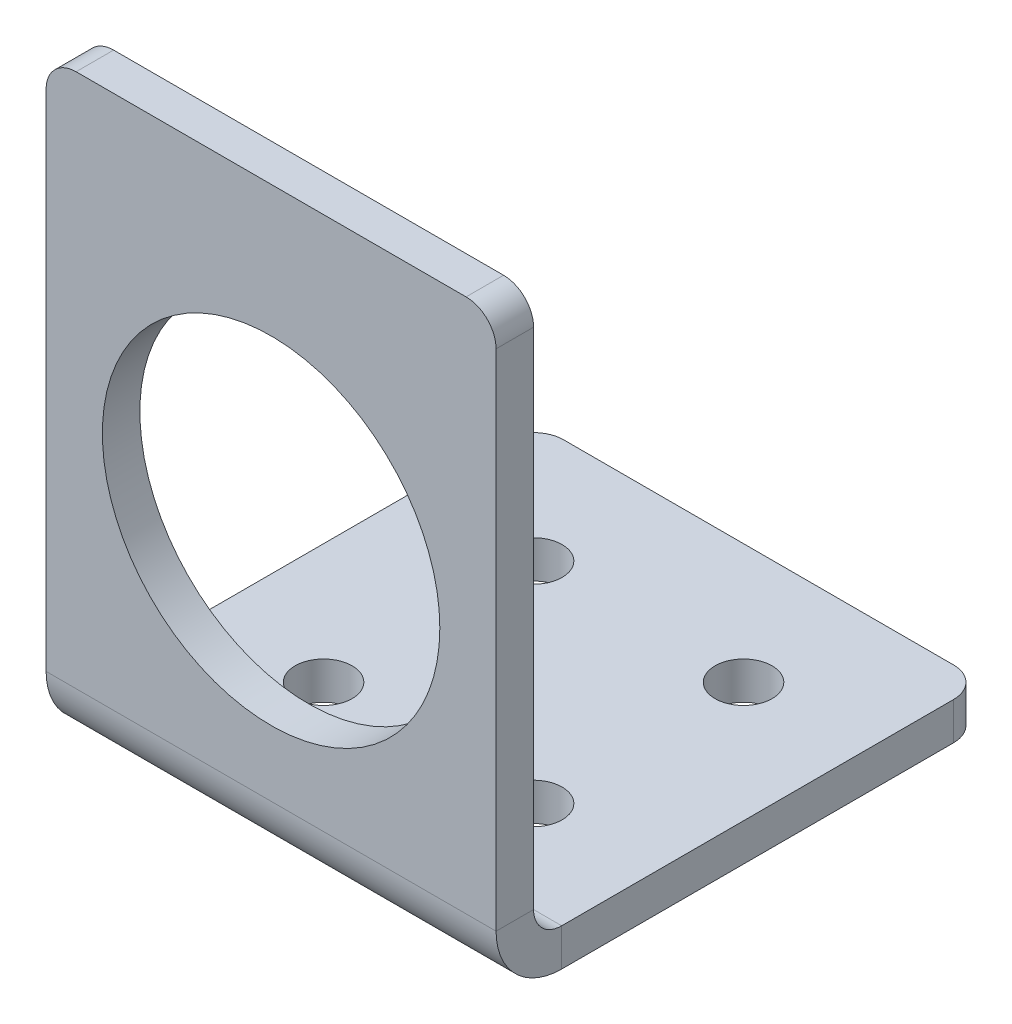
ISO-10303-21;
HEADER;
FILE_DESCRIPTION(('STEP AP214'),'2;1');
FILE_NAME('part.step','',(''),(''),'','','');
FILE_SCHEMA(('AUTOMOTIVE_DESIGN { 1 0 10303 214 1 1 1 1 }'));
ENDSEC;
DATA;
#1=APPLICATION_CONTEXT('core data for automotive mechanical design processes');
#2=APPLICATION_PROTOCOL_DEFINITION('international standard','automotive_design',2000,#1);
#3=PRODUCT_CONTEXT('',#1,'mechanical');
#4=PRODUCT('Part','Part','',(#3));
#5=PRODUCT_RELATED_PRODUCT_CATEGORY('part','',(#4));
#6=PRODUCT_DEFINITION_FORMATION('','',#4);
#7=PRODUCT_DEFINITION_CONTEXT('part definition',#1,'design');
#8=PRODUCT_DEFINITION('design','',#6,#7);
#9=PRODUCT_DEFINITION_SHAPE('','',#8);
#10=(LENGTH_UNIT() NAMED_UNIT(*) SI_UNIT(.MILLI.,.METRE.));
#11=(NAMED_UNIT(*) PLANE_ANGLE_UNIT() SI_UNIT($,.RADIAN.));
#12=(NAMED_UNIT(*) SI_UNIT($,.STERADIAN.) SOLID_ANGLE_UNIT());
#13=UNCERTAINTY_MEASURE_WITH_UNIT(LENGTH_MEASURE(1.E-05),#10,'distance_accuracy_value','');
#14=(GEOMETRIC_REPRESENTATION_CONTEXT(3) GLOBAL_UNCERTAINTY_ASSIGNED_CONTEXT((#13)) GLOBAL_UNIT_ASSIGNED_CONTEXT((#10,
#11,#12)) REPRESENTATION_CONTEXT('',''));
#15=CARTESIAN_POINT('',(0.,0.,0.));
#16=DIRECTION('',(0.,0.,1.));
#17=DIRECTION('',(1.,0.,0.));
#18=AXIS2_PLACEMENT_3D('',#15,#16,#17);
#19=CARTESIAN_POINT('',(19.05,-22.225,-38.1));
#20=DIRECTION('',(1.,0.,0.));
#21=DIRECTION('',(0.,0.,1.));
#22=AXIS2_PLACEMENT_3D('',#19,#20,#21);
#23=PLANE('',#22);
#24=DIRECTION('',(0.,0.,1.));
#25=VECTOR('',#24,1.);
#26=CARTESIAN_POINT('',(19.05,-25.4,-38.1));
#27=LINE('',#26,#25);
#28=CARTESIAN_POINT('',(19.05,-25.4,-35.56));
#29=VERTEX_POINT('',#28);
#30=CARTESIAN_POINT('',(19.05,-25.4,-2.38000006600003));
#31=VERTEX_POINT('',#30);
#32=EDGE_CURVE('E197',#29,#31,#27,.T.);
#33=ORIENTED_EDGE('',*,*,#32,.F.);
#34=DIRECTION('',(0.,1.,0.));
#35=VECTOR('',#34,1.);
#36=CARTESIAN_POINT('',(19.05,-22.225,-35.56));
#37=LINE('',#36,#35);
#38=CARTESIAN_POINT('',(19.05,-22.225,-35.56));
#39=VERTEX_POINT('',#38);
#40=EDGE_CURVE('E133',#29,#39,#37,.T.);
#41=ORIENTED_EDGE('',*,*,#40,.T.);
#42=DIRECTION('',(0.,0.,1.));
#43=VECTOR('',#42,1.);
#44=CARTESIAN_POINT('',(19.05,-22.225,-38.1));
#45=LINE('',#44,#43);
#46=CARTESIAN_POINT('',(19.05,-22.225,-2.38000006600001));
#47=VERTEX_POINT('',#46);
#48=EDGE_CURVE('E127',#39,#47,#45,.T.);
#49=ORIENTED_EDGE('',*,*,#48,.T.);
#50=DIRECTION('',(0.,1.,0.));
#51=VECTOR('',#50,1.);
#52=CARTESIAN_POINT('',(19.05,-22.225,-2.38000006600001));
#53=LINE('',#52,#51);
#54=EDGE_CURVE('E130',#31,#47,#53,.T.);
#55=ORIENTED_EDGE('',*,*,#54,.F.);
#56=EDGE_LOOP('',(#33,#41,#49,#55));
#57=FACE_BOUND('',#56,.T.);
#58=ADVANCED_FACE('F36',(#57),#23,.T.);
#59=CARTESIAN_POINT('',(19.05,-22.225,-38.1));
#60=DIRECTION('',(0.,0.,-1.));
#61=DIRECTION('',(1.,0.,0.));
#62=AXIS2_PLACEMENT_3D('',#59,#60,#61);
#63=PLANE('',#62);
#64=DIRECTION('',(1.,0.,0.));
#65=VECTOR('',#64,1.);
#66=CARTESIAN_POINT('',(19.05,-22.225,-38.1));
#67=LINE('',#66,#65);
#68=CARTESIAN_POINT('',(-16.51,-22.225,-38.1));
#69=VERTEX_POINT('',#68);
#70=CARTESIAN_POINT('',(16.51,-22.225,-38.1));
#71=VERTEX_POINT('',#70);
#72=EDGE_CURVE('E136',#69,#71,#67,.T.);
#73=ORIENTED_EDGE('',*,*,#72,.T.);
#74=DIRECTION('',(0.,1.,0.));
#75=VECTOR('',#74,1.);
#76=CARTESIAN_POINT('',(16.51,-22.225,-38.1));
#77=LINE('',#76,#75);
#78=CARTESIAN_POINT('',(16.51,-25.4,-38.1));
#79=VERTEX_POINT('',#78);
#80=EDGE_CURVE('E57',#71,#79,#77,.F.);
#81=ORIENTED_EDGE('',*,*,#80,.T.);
#82=DIRECTION('',(1.,0.,0.));
#83=VECTOR('',#82,1.);
#84=CARTESIAN_POINT('',(19.05,-25.4,-38.1));
#85=LINE('',#84,#83);
#86=CARTESIAN_POINT('',(-16.51,-25.4,-38.1));
#87=VERTEX_POINT('',#86);
#88=EDGE_CURVE('E195',#87,#79,#85,.T.);
#89=ORIENTED_EDGE('',*,*,#88,.F.);
#90=DIRECTION('',(0.,-1.,0.));
#91=VECTOR('',#90,1.);
#92=CARTESIAN_POINT('',(-16.51,-22.225,-38.1));
#93=LINE('',#92,#91);
#94=EDGE_CURVE('E240',#87,#69,#93,.F.);
#95=ORIENTED_EDGE('',*,*,#94,.T.);
#96=EDGE_LOOP('',(#73,#81,#89,#95));
#97=FACE_BOUND('',#96,.T.);
#98=ADVANCED_FACE('F252',(#97),#63,.T.);
#99=CARTESIAN_POINT('',(-19.05,-22.225,-38.1));
#100=DIRECTION('',(1.,0.,0.));
#101=DIRECTION('',(0.,0.,1.));
#102=AXIS2_PLACEMENT_3D('',#99,#100,#101);
#103=PLANE('',#102);
#104=DIRECTION('',(0.,0.,1.));
#105=VECTOR('',#104,1.);
#106=CARTESIAN_POINT('',(-19.05,-22.225,-38.1));
#107=LINE('',#106,#105);
#108=CARTESIAN_POINT('',(-19.05,-22.225,-35.56));
#109=VERTEX_POINT('',#108);
#110=CARTESIAN_POINT('',(-19.05,-22.225,-2.38000006600001));
#111=VERTEX_POINT('',#110);
#112=EDGE_CURVE('E163',#109,#111,#107,.T.);
#113=ORIENTED_EDGE('',*,*,#112,.F.);
#114=DIRECTION('',(0.,1.,0.));
#115=VECTOR('',#114,1.);
#116=CARTESIAN_POINT('',(-19.05,-22.225,-35.56));
#117=LINE('',#116,#115);
#118=CARTESIAN_POINT('',(-19.05,-25.4,-35.56));
#119=VERTEX_POINT('',#118);
#120=EDGE_CURVE('E11',#109,#119,#117,.F.);
#121=ORIENTED_EDGE('',*,*,#120,.T.);
#122=DIRECTION('',(0.,0.,1.));
#123=VECTOR('',#122,1.);
#124=CARTESIAN_POINT('',(-19.05,-25.4,-38.1));
#125=LINE('',#124,#123);
#126=CARTESIAN_POINT('',(-19.05,-25.4,-2.38000006600001));
#127=VERTEX_POINT('',#126);
#128=EDGE_CURVE('E189',#119,#127,#125,.T.);
#129=ORIENTED_EDGE('',*,*,#128,.T.);
#130=DIRECTION('',(0.,1.,0.));
#131=VECTOR('',#130,1.);
#132=CARTESIAN_POINT('',(-19.05,-22.225,-2.38000006600001));
#133=LINE('',#132,#131);
#134=EDGE_CURVE('E149',#127,#111,#133,.T.);
#135=ORIENTED_EDGE('',*,*,#134,.T.);
#136=EDGE_LOOP('',(#113,#121,#129,#135));
#137=FACE_BOUND('',#136,.T.);
#138=ADVANCED_FACE('F299',(#137),#103,.F.);
#139=CARTESIAN_POINT('',(-19.05,-19.844999934,-2.380000066));
#140=DIRECTION('',(1.,0.,0.));
#141=DIRECTION('',(0.,0.,-1.));
#142=AXIS2_PLACEMENT_3D('',#139,#140,#141);
#143=PLANE('',#142);
#144=ORIENTED_EDGE('',*,*,#134,.F.);
#145=CARTESIAN_POINT('',(-19.05,-19.844999934,-2.380000066));
#146=DIRECTION('',(1.,0.,0.));
#147=DIRECTION('',(0.,1.,0.));
#148=AXIS2_PLACEMENT_3D('',#145,#146,#147);
#149=CIRCLE('',#148,5.555000066);
#150=CARTESIAN_POINT('',(-19.05,-19.844999934,3.175));
#151=VERTEX_POINT('',#150);
#152=EDGE_CURVE('E190',#127,#151,#149,.F.);
#153=ORIENTED_EDGE('',*,*,#152,.T.);
#154=DIRECTION('',(0.,0.,-1.));
#155=VECTOR('',#154,1.);
#156=CARTESIAN_POINT('',(-19.05,-19.844999934,0.));
#157=LINE('',#156,#155);
#158=CARTESIAN_POINT('',(-19.05,-19.844999934,0.));
#159=VERTEX_POINT('',#158);
#160=EDGE_CURVE('E213',#151,#159,#157,.T.);
#161=ORIENTED_EDGE('',*,*,#160,.T.);
#162=CARTESIAN_POINT('',(-19.05,-19.844999934,-2.380000066));
#163=DIRECTION('',(-1.,0.,0.));
#164=DIRECTION('',(0.,0.,1.));
#165=AXIS2_PLACEMENT_3D('',#162,#163,#164);
#166=CIRCLE('',#165,2.380000066);
#167=EDGE_CURVE('E159',#111,#159,#166,.T.);
#168=ORIENTED_EDGE('',*,*,#167,.F.);
#169=EDGE_LOOP('',(#144,#153,#161,#168));
#170=FACE_BOUND('',#169,.T.);
#171=ADVANCED_FACE('F296',(#170),#143,.F.);
#172=CARTESIAN_POINT('',(-19.05,-25.4,0.));
#173=DIRECTION('',(1.,0.,0.));
#174=DIRECTION('',(0.,-1.,0.));
#175=AXIS2_PLACEMENT_3D('',#172,#173,#174);
#176=PLANE('',#175);
#177=DIRECTION('',(0.,1.,0.));
#178=VECTOR('',#177,1.);
#179=CARTESIAN_POINT('',(-19.05,0.,3.175));
#180=LINE('',#179,#178);
#181=CARTESIAN_POINT('',(-19.05,22.86,3.175));
#182=VERTEX_POINT('',#181);
#183=EDGE_CURVE('E187',#182,#151,#180,.F.);
#184=ORIENTED_EDGE('',*,*,#183,.F.);
#185=DIRECTION('',(0.,0.,1.));
#186=VECTOR('',#185,1.);
#187=CARTESIAN_POINT('',(-19.05,22.86,0.));
#188=LINE('',#187,#186);
#189=CARTESIAN_POINT('',(-19.05,22.86,0.));
#190=VERTEX_POINT('',#189);
#191=EDGE_CURVE('E148',#182,#190,#188,.F.);
#192=ORIENTED_EDGE('',*,*,#191,.T.);
#193=DIRECTION('',(0.,-1.,0.));
#194=VECTOR('',#193,1.);
#195=CARTESIAN_POINT('',(-19.05,-25.4,0.));
#196=LINE('',#195,#194);
#197=EDGE_CURVE('E255',#190,#159,#196,.T.);
#198=ORIENTED_EDGE('',*,*,#197,.T.);
#199=ORIENTED_EDGE('',*,*,#160,.F.);
#200=EDGE_LOOP('',(#184,#192,#198,#199));
#201=FACE_BOUND('',#200,.T.);
#202=ADVANCED_FACE('F288',(#201),#176,.F.);
#203=CARTESIAN_POINT('',(-19.05,25.4,0.));
#204=DIRECTION('',(0.,-1.,0.));
#205=DIRECTION('',(-1.,0.,0.));
#206=AXIS2_PLACEMENT_3D('',#203,#204,#205);
#207=PLANE('',#206);
#208=DIRECTION('',(-1.,0.,0.));
#209=VECTOR('',#208,1.);
#210=CARTESIAN_POINT('',(-19.05,25.4,0.));
#211=LINE('',#210,#209);
#212=CARTESIAN_POINT('',(16.51,25.4,0.));
#213=VERTEX_POINT('',#212);
#214=CARTESIAN_POINT('',(-16.51,25.4,0.));
#215=VERTEX_POINT('',#214);
#216=EDGE_CURVE('E260',#213,#215,#211,.T.);
#217=ORIENTED_EDGE('',*,*,#216,.T.);
#218=DIRECTION('',(0.,0.,1.));
#219=VECTOR('',#218,1.);
#220=CARTESIAN_POINT('',(-16.51,25.4,0.));
#221=LINE('',#220,#219);
#222=CARTESIAN_POINT('',(-16.51,25.4,3.175));
#223=VERTEX_POINT('',#222);
#224=EDGE_CURVE('E227',#215,#223,#221,.T.);
#225=ORIENTED_EDGE('',*,*,#224,.T.);
#226=DIRECTION('',(-1.,0.,0.));
#227=VECTOR('',#226,1.);
#228=CARTESIAN_POINT('',(0.,25.4,3.175));
#229=LINE('',#228,#227);
#230=CARTESIAN_POINT('',(16.51,25.4,3.175));
#231=VERTEX_POINT('',#230);
#232=EDGE_CURVE('E184',#231,#223,#229,.T.);
#233=ORIENTED_EDGE('',*,*,#232,.F.);
#234=DIRECTION('',(0.,0.,1.));
#235=VECTOR('',#234,1.);
#236=CARTESIAN_POINT('',(16.51,25.4,0.));
#237=LINE('',#236,#235);
#238=EDGE_CURVE('E224',#231,#213,#237,.F.);
#239=ORIENTED_EDGE('',*,*,#238,.T.);
#240=EDGE_LOOP('',(#217,#225,#233,#239));
#241=FACE_BOUND('',#240,.T.);
#242=ADVANCED_FACE('F279',(#241),#207,.F.);
#243=CARTESIAN_POINT('',(19.05,-25.4,0.));
#244=DIRECTION('',(-1.,0.,0.));
#245=DIRECTION('',(0.,1.,0.));
#246=AXIS2_PLACEMENT_3D('',#243,#244,#245);
#247=PLANE('',#246);
#248=DIRECTION('',(0.,1.,0.));
#249=VECTOR('',#248,1.);
#250=CARTESIAN_POINT('',(19.05,-25.4,0.));
#251=LINE('',#250,#249);
#252=CARTESIAN_POINT('',(19.05,-19.844999934,0.));
#253=VERTEX_POINT('',#252);
#254=CARTESIAN_POINT('',(19.05,22.86,0.));
#255=VERTEX_POINT('',#254);
#256=EDGE_CURVE('E170',#253,#255,#251,.T.);
#257=ORIENTED_EDGE('',*,*,#256,.T.);
#258=DIRECTION('',(0.,0.,1.));
#259=VECTOR('',#258,1.);
#260=CARTESIAN_POINT('',(19.05,22.86,0.));
#261=LINE('',#260,#259);
#262=CARTESIAN_POINT('',(19.05,22.86,3.175));
#263=VERTEX_POINT('',#262);
#264=EDGE_CURVE('E233',#255,#263,#261,.T.);
#265=ORIENTED_EDGE('',*,*,#264,.T.);
#266=DIRECTION('',(0.,1.,0.));
#267=VECTOR('',#266,1.);
#268=CARTESIAN_POINT('',(19.05,0.,3.175));
#269=LINE('',#268,#267);
#270=CARTESIAN_POINT('',(19.05,-19.844999934,3.175));
#271=VERTEX_POINT('',#270);
#272=EDGE_CURVE('E181',#271,#263,#269,.T.);
#273=ORIENTED_EDGE('',*,*,#272,.F.);
#274=DIRECTION('',(0.,0.,-1.));
#275=VECTOR('',#274,1.);
#276=CARTESIAN_POINT('',(19.05,-19.844999934,0.));
#277=LINE('',#276,#275);
#278=EDGE_CURVE('E167',#271,#253,#277,.T.);
#279=ORIENTED_EDGE('',*,*,#278,.T.);
#280=EDGE_LOOP('',(#257,#265,#273,#279));
#281=FACE_BOUND('',#280,.T.);
#282=ADVANCED_FACE('F265',(#281),#247,.F.);
#283=CARTESIAN_POINT('',(8.89,-22.225,-27.94));
#284=DIRECTION('',(0.,-1.,0.));
#285=DIRECTION('',(1.,0.,0.));
#286=AXIS2_PLACEMENT_3D('',#283,#284,#285);
#287=CYLINDRICAL_SURFACE('',#286,2.413);
#288=CARTESIAN_POINT('',(8.89,-22.225,-27.94));
#289=DIRECTION('',(0.,1.,0.));
#290=DIRECTION('',(-1.,0.,0.));
#291=AXIS2_PLACEMENT_3D('',#288,#289,#290);
#292=CIRCLE('',#291,2.413);
#293=CARTESIAN_POINT('',(6.47699999999999,-22.225,-27.94));
#294=VERTEX_POINT('',#293);
#295=EDGE_CURVE('E175',#294,#294,#292,.T.);
#296=ORIENTED_EDGE('',*,*,#295,.T.);
#297=EDGE_LOOP('',(#296));
#298=FACE_BOUND('',#297,.T.);
#299=CARTESIAN_POINT('',(8.89,-25.4,-27.94));
#300=DIRECTION('',(0.,1.,0.));
#301=DIRECTION('',(-1.,0.,0.));
#302=AXIS2_PLACEMENT_3D('',#299,#300,#301);
#303=CIRCLE('',#302,2.413);
#304=CARTESIAN_POINT('',(6.47699999999999,-25.4,-27.94));
#305=VERTEX_POINT('',#304);
#306=EDGE_CURVE('E193',#305,#305,#303,.T.);
#307=ORIENTED_EDGE('',*,*,#306,.F.);
#308=EDGE_LOOP('',(#307));
#309=FACE_BOUND('',#308,.T.);
#310=ADVANCED_FACE('F321',(#298,#309),#287,.F.);
#311=CARTESIAN_POINT('',(-8.89000000000001,-22.225,-10.16));
#312=DIRECTION('',(0.,-1.,0.));
#313=DIRECTION('',(1.,0.,0.));
#314=AXIS2_PLACEMENT_3D('',#311,#312,#313);
#315=CYLINDRICAL_SURFACE('',#314,2.413);
#316=CARTESIAN_POINT('',(-8.89000000000001,-22.225,-10.16));
#317=DIRECTION('',(0.,1.,0.));
#318=DIRECTION('',(-1.,0.,0.));
#319=AXIS2_PLACEMENT_3D('',#316,#317,#318);
#320=CIRCLE('',#319,2.413);
#321=CARTESIAN_POINT('',(-11.303,-22.225,-10.16));
#322=VERTEX_POINT('',#321);
#323=EDGE_CURVE('E576',#322,#322,#320,.T.);
#324=ORIENTED_EDGE('',*,*,#323,.T.);
#325=EDGE_LOOP('',(#324));
#326=FACE_BOUND('',#325,.T.);
#327=CARTESIAN_POINT('',(-8.89000000000001,-25.4,-10.16));
#328=DIRECTION('',(0.,1.,0.));
#329=DIRECTION('',(-1.,0.,0.));
#330=AXIS2_PLACEMENT_3D('',#327,#328,#329);
#331=CIRCLE('',#330,2.413);
#332=CARTESIAN_POINT('',(-11.303,-25.4,-10.16));
#333=VERTEX_POINT('',#332);
#334=EDGE_CURVE('E205',#333,#333,#331,.T.);
#335=ORIENTED_EDGE('',*,*,#334,.F.);
#336=EDGE_LOOP('',(#335));
#337=FACE_BOUND('',#336,.T.);
#338=ADVANCED_FACE('F324',(#326,#337),#315,.F.);
#339=CARTESIAN_POINT('',(8.88999999999999,-22.225,-10.16));
#340=DIRECTION('',(0.,-1.,0.));
#341=DIRECTION('',(1.,0.,0.));
#342=AXIS2_PLACEMENT_3D('',#339,#340,#341);
#343=CYLINDRICAL_SURFACE('',#342,2.413);
#344=CARTESIAN_POINT('',(8.88999999999999,-22.225,-10.16));
#345=DIRECTION('',(0.,1.,0.));
#346=DIRECTION('',(-1.,0.,0.));
#347=AXIS2_PLACEMENT_3D('',#344,#345,#346);
#348=CIRCLE('',#347,2.413);
#349=CARTESIAN_POINT('',(6.47699999999999,-22.225,-10.16));
#350=VERTEX_POINT('',#349);
#351=EDGE_CURVE('E580',#350,#350,#348,.T.);
#352=ORIENTED_EDGE('',*,*,#351,.T.);
#353=EDGE_LOOP('',(#352));
#354=FACE_BOUND('',#353,.T.);
#355=CARTESIAN_POINT('',(8.88999999999999,-25.4,-10.16));
#356=DIRECTION('',(0.,1.,0.));
#357=DIRECTION('',(-1.,0.,0.));
#358=AXIS2_PLACEMENT_3D('',#355,#356,#357);
#359=CIRCLE('',#358,2.413);
#360=CARTESIAN_POINT('',(6.47699999999999,-25.4,-10.16));
#361=VERTEX_POINT('',#360);
#362=EDGE_CURVE('E208',#361,#361,#359,.T.);
#363=ORIENTED_EDGE('',*,*,#362,.F.);
#364=EDGE_LOOP('',(#363));
#365=FACE_BOUND('',#364,.T.);
#366=ADVANCED_FACE('F328',(#354,#365),#343,.F.);
#367=CARTESIAN_POINT('',(-8.89000000000001,-22.225,-27.94));
#368=DIRECTION('',(0.,-1.,0.));
#369=DIRECTION('',(1.,0.,0.));
#370=AXIS2_PLACEMENT_3D('',#367,#368,#369);
#371=CYLINDRICAL_SURFACE('',#370,2.413);
#372=CARTESIAN_POINT('',(-8.89000000000001,-22.225,-27.94));
#373=DIRECTION('',(0.,1.,0.));
#374=DIRECTION('',(-1.,0.,0.));
#375=AXIS2_PLACEMENT_3D('',#372,#373,#374);
#376=CIRCLE('',#375,2.413);
#377=CARTESIAN_POINT('',(-11.303,-22.225,-27.94));
#378=VERTEX_POINT('',#377);
#379=EDGE_CURVE('E137',#378,#378,#376,.T.);
#380=ORIENTED_EDGE('',*,*,#379,.T.);
#381=EDGE_LOOP('',(#380));
#382=FACE_BOUND('',#381,.T.);
#383=CARTESIAN_POINT('',(-8.89000000000001,-25.4,-27.94));
#384=DIRECTION('',(0.,1.,0.));
#385=DIRECTION('',(-1.,0.,0.));
#386=AXIS2_PLACEMENT_3D('',#383,#384,#385);
#387=CIRCLE('',#386,2.413);
#388=CARTESIAN_POINT('',(-11.303,-25.4,-27.94));
#389=VERTEX_POINT('',#388);
#390=EDGE_CURVE('E199',#389,#389,#387,.T.);
#391=ORIENTED_EDGE('',*,*,#390,.F.);
#392=EDGE_LOOP('',(#391));
#393=FACE_BOUND('',#392,.T.);
#394=ADVANCED_FACE('F316',(#382,#393),#371,.F.);
#395=CARTESIAN_POINT('',(19.05,-19.844999934,-2.380000066));
#396=DIRECTION('',(1.,0.,0.));
#397=DIRECTION('',(0.,0.,-1.));
#398=AXIS2_PLACEMENT_3D('',#395,#396,#397);
#399=PLANE('',#398);
#400=CARTESIAN_POINT('',(19.05,-19.844999934,-2.380000066));
#401=DIRECTION('',(1.,0.,0.));
#402=DIRECTION('',(0.,1.,0.));
#403=AXIS2_PLACEMENT_3D('',#400,#401,#402);
#404=CIRCLE('',#403,5.555000066);
#405=EDGE_CURVE('E147',#271,#31,#404,.T.);
#406=ORIENTED_EDGE('',*,*,#405,.T.);
#407=ORIENTED_EDGE('',*,*,#54,.T.);
#408=CARTESIAN_POINT('',(19.05,-19.844999934,-2.380000066));
#409=DIRECTION('',(-1.,0.,0.));
#410=DIRECTION('',(0.,0.,1.));
#411=AXIS2_PLACEMENT_3D('',#408,#409,#410);
#412=CIRCLE('',#411,2.380000066);
#413=EDGE_CURVE('E144',#253,#47,#412,.F.);
#414=ORIENTED_EDGE('',*,*,#413,.F.);
#415=ORIENTED_EDGE('',*,*,#278,.F.);
#416=EDGE_LOOP('',(#406,#407,#414,#415));
#417=FACE_BOUND('',#416,.T.);
#418=ADVANCED_FACE('F143',(#417),#399,.T.);
#419=CARTESIAN_POINT('',(0.,0.,0.));
#420=DIRECTION('',(0.,0.,-1.));
#421=DIRECTION('',(-1.,0.,0.));
#422=AXIS2_PLACEMENT_3D('',#419,#420,#421);
#423=CYLINDRICAL_SURFACE('',#422,14.2875);
#424=CARTESIAN_POINT('',(0.,0.,0.));
#425=DIRECTION('',(0.,0.,1.));
#426=DIRECTION('',(1.,0.,0.));
#427=AXIS2_PLACEMENT_3D('',#424,#425,#426);
#428=CIRCLE('',#427,14.2875);
#429=CARTESIAN_POINT('',(14.2875,0.,0.));
#430=VERTEX_POINT('',#429);
#431=EDGE_CURVE('E165',#430,#430,#428,.T.);
#432=ORIENTED_EDGE('',*,*,#431,.F.);
#433=EDGE_LOOP('',(#432));
#434=FACE_BOUND('',#433,.T.);
#435=CARTESIAN_POINT('',(0.,0.,3.175));
#436=DIRECTION('',(0.,0.,1.));
#437=DIRECTION('',(1.,0.,0.));
#438=AXIS2_PLACEMENT_3D('',#435,#436,#437);
#439=CIRCLE('',#438,14.2875);
#440=CARTESIAN_POINT('',(14.2875,0.,3.175));
#441=VERTEX_POINT('',#440);
#442=EDGE_CURVE('E180',#441,#441,#439,.T.);
#443=ORIENTED_EDGE('',*,*,#442,.T.);
#444=EDGE_LOOP('',(#443));
#445=FACE_BOUND('',#444,.T.);
#446=ADVANCED_FACE('F315',(#434,#445),#423,.F.);
#447=CARTESIAN_POINT('',(0.,0.,0.));
#448=DIRECTION('',(0.,0.,-1.));
#449=DIRECTION('',(-1.,0.,0.));
#450=AXIS2_PLACEMENT_3D('',#447,#448,#449);
#451=PLANE('',#450);
#452=ORIENTED_EDGE('',*,*,#197,.F.);
#453=CARTESIAN_POINT('',(-16.51,22.86,0.));
#454=DIRECTION('',(0.,0.,-1.));
#455=DIRECTION('',(-1.,0.,0.));
#456=AXIS2_PLACEMENT_3D('',#453,#454,#455);
#457=CIRCLE('',#456,2.54);
#458=EDGE_CURVE('E222',#190,#215,#457,.T.);
#459=ORIENTED_EDGE('',*,*,#458,.T.);
#460=ORIENTED_EDGE('',*,*,#216,.F.);
#461=CARTESIAN_POINT('',(16.51,22.86,0.));
#462=DIRECTION('',(0.,0.,-1.));
#463=DIRECTION('',(-1.,0.,0.));
#464=AXIS2_PLACEMENT_3D('',#461,#462,#463);
#465=CIRCLE('',#464,2.54);
#466=EDGE_CURVE('E220',#213,#255,#465,.T.);
#467=ORIENTED_EDGE('',*,*,#466,.T.);
#468=ORIENTED_EDGE('',*,*,#256,.F.);
#469=DIRECTION('',(1.,0.,0.));
#470=VECTOR('',#469,1.);
#471=CARTESIAN_POINT('',(0.,-19.844999934,0.));
#472=LINE('',#471,#470);
#473=EDGE_CURVE('E158',#253,#159,#472,.F.);
#474=ORIENTED_EDGE('',*,*,#473,.T.);
#475=EDGE_LOOP('',(#452,#459,#460,#467,#468,#474));
#476=FACE_BOUND('',#475,.T.);
#477=ORIENTED_EDGE('',*,*,#431,.T.);
#478=EDGE_LOOP('',(#477));
#479=FACE_BOUND('',#478,.T.);
#480=ADVANCED_FACE('F319',(#476,#479),#451,.T.);
#481=CARTESIAN_POINT('',(19.05,-22.225,-38.1));
#482=DIRECTION('',(0.,-1.,0.));
#483=DIRECTION('',(1.,0.,0.));
#484=AXIS2_PLACEMENT_3D('',#481,#482,#483);
#485=PLANE('',#484);
#486=ORIENTED_EDGE('',*,*,#295,.F.);
#487=EDGE_LOOP('',(#486));
#488=FACE_BOUND('',#487,.T.);
#489=ORIENTED_EDGE('',*,*,#323,.F.);
#490=EDGE_LOOP('',(#489));
#491=FACE_BOUND('',#490,.T.);
#492=ORIENTED_EDGE('',*,*,#351,.F.);
#493=EDGE_LOOP('',(#492));
#494=FACE_BOUND('',#493,.T.);
#495=ORIENTED_EDGE('',*,*,#379,.F.);
#496=EDGE_LOOP('',(#495));
#497=FACE_BOUND('',#496,.T.);
#498=ORIENTED_EDGE('',*,*,#48,.F.);
#499=CARTESIAN_POINT('',(16.51,-22.225,-35.56));
#500=DIRECTION('',(0.,-1.,0.));
#501=DIRECTION('',(1.,0.,0.));
#502=AXIS2_PLACEMENT_3D('',#499,#500,#501);
#503=CIRCLE('',#502,2.54);
#504=EDGE_CURVE('E238',#39,#71,#503,.F.);
#505=ORIENTED_EDGE('',*,*,#504,.T.);
#506=ORIENTED_EDGE('',*,*,#72,.F.);
#507=CARTESIAN_POINT('',(-16.51,-22.225,-35.56));
#508=DIRECTION('',(0.,-1.,0.));
#509=DIRECTION('',(1.,0.,0.));
#510=AXIS2_PLACEMENT_3D('',#507,#508,#509);
#511=CIRCLE('',#510,2.54);
#512=EDGE_CURVE('E236',#69,#109,#511,.F.);
#513=ORIENTED_EDGE('',*,*,#512,.T.);
#514=ORIENTED_EDGE('',*,*,#112,.T.);
#515=DIRECTION('',(1.,0.,0.));
#516=VECTOR('',#515,1.);
#517=CARTESIAN_POINT('',(19.05,-22.225,-2.380000066));
#518=LINE('',#517,#516);
#519=EDGE_CURVE('E156',#111,#47,#518,.T.);
#520=ORIENTED_EDGE('',*,*,#519,.T.);
#521=EDGE_LOOP('',(#498,#505,#506,#513,#514,#520));
#522=FACE_BOUND('',#521,.T.);
#523=ADVANCED_FACE('F162',(#488,#491,#494,#497,#522),#485,.F.);
#524=CARTESIAN_POINT('',(19.05,-19.844999934,-2.380000066));
#525=DIRECTION('',(1.,0.,0.));
#526=DIRECTION('',(0.,1.,0.));
#527=AXIS2_PLACEMENT_3D('',#524,#525,#526);
#528=CYLINDRICAL_SURFACE('',#527,2.380000066);
#529=ORIENTED_EDGE('',*,*,#167,.T.);
#530=ORIENTED_EDGE('',*,*,#473,.F.);
#531=ORIENTED_EDGE('',*,*,#413,.T.);
#532=ORIENTED_EDGE('',*,*,#519,.F.);
#533=EDGE_LOOP('',(#529,#530,#531,#532));
#534=FACE_BOUND('',#533,.T.);
#535=ADVANCED_FACE('F155',(#534),#528,.F.);
#536=CARTESIAN_POINT('',(0.,0.,3.175));
#537=DIRECTION('',(0.,0.,-1.));
#538=DIRECTION('',(-1.,0.,0.));
#539=AXIS2_PLACEMENT_3D('',#536,#537,#538);
#540=PLANE('',#539);
#541=ORIENTED_EDGE('',*,*,#232,.T.);
#542=CARTESIAN_POINT('',(-16.51,22.86,3.175));
#543=DIRECTION('',(0.,0.,-1.));
#544=DIRECTION('',(-1.,0.,0.));
#545=AXIS2_PLACEMENT_3D('',#542,#543,#544);
#546=CIRCLE('',#545,2.54);
#547=EDGE_CURVE('E231',#223,#182,#546,.F.);
#548=ORIENTED_EDGE('',*,*,#547,.T.);
#549=ORIENTED_EDGE('',*,*,#183,.T.);
#550=DIRECTION('',(-1.,0.,0.));
#551=VECTOR('',#550,1.);
#552=CARTESIAN_POINT('',(0.,-19.844999934,3.175));
#553=LINE('',#552,#551);
#554=EDGE_CURVE('E160',#271,#151,#553,.T.);
#555=ORIENTED_EDGE('',*,*,#554,.F.);
#556=ORIENTED_EDGE('',*,*,#272,.T.);
#557=CARTESIAN_POINT('',(16.51,22.86,3.175));
#558=DIRECTION('',(0.,0.,-1.));
#559=DIRECTION('',(-1.,0.,0.));
#560=AXIS2_PLACEMENT_3D('',#557,#558,#559);
#561=CIRCLE('',#560,2.54);
#562=EDGE_CURVE('E229',#263,#231,#561,.F.);
#563=ORIENTED_EDGE('',*,*,#562,.T.);
#564=EDGE_LOOP('',(#541,#548,#549,#555,#556,#563));
#565=FACE_BOUND('',#564,.T.);
#566=ORIENTED_EDGE('',*,*,#442,.F.);
#567=EDGE_LOOP('',(#566));
#568=FACE_BOUND('',#567,.T.);
#569=ADVANCED_FACE('F274',(#565,#568),#540,.F.);
#570=CARTESIAN_POINT('',(19.05,-25.4,-38.1));
#571=DIRECTION('',(0.,-1.,0.));
#572=DIRECTION('',(1.,0.,0.));
#573=AXIS2_PLACEMENT_3D('',#570,#571,#572);
#574=PLANE('',#573);
#575=ORIENTED_EDGE('',*,*,#306,.T.);
#576=EDGE_LOOP('',(#575));
#577=FACE_BOUND('',#576,.T.);
#578=ORIENTED_EDGE('',*,*,#334,.T.);
#579=EDGE_LOOP('',(#578));
#580=FACE_BOUND('',#579,.T.);
#581=ORIENTED_EDGE('',*,*,#362,.T.);
#582=EDGE_LOOP('',(#581));
#583=FACE_BOUND('',#582,.T.);
#584=ORIENTED_EDGE('',*,*,#390,.T.);
#585=EDGE_LOOP('',(#584));
#586=FACE_BOUND('',#585,.T.);
#587=ORIENTED_EDGE('',*,*,#88,.T.);
#588=CARTESIAN_POINT('',(16.51,-25.4,-35.56));
#589=DIRECTION('',(0.,-1.,0.));
#590=DIRECTION('',(1.,0.,0.));
#591=AXIS2_PLACEMENT_3D('',#588,#589,#590);
#592=CIRCLE('',#591,2.54);
#593=EDGE_CURVE('E44',#79,#29,#592,.T.);
#594=ORIENTED_EDGE('',*,*,#593,.T.);
#595=ORIENTED_EDGE('',*,*,#32,.T.);
#596=DIRECTION('',(1.,0.,0.));
#597=VECTOR('',#596,1.);
#598=CARTESIAN_POINT('',(19.05,-25.4,-2.38000006600001));
#599=LINE('',#598,#597);
#600=EDGE_CURVE('E178',#127,#31,#599,.T.);
#601=ORIENTED_EDGE('',*,*,#600,.F.);
#602=ORIENTED_EDGE('',*,*,#128,.F.);
#603=CARTESIAN_POINT('',(-16.51,-25.4,-35.56));
#604=DIRECTION('',(0.,-1.,0.));
#605=DIRECTION('',(1.,0.,0.));
#606=AXIS2_PLACEMENT_3D('',#603,#604,#605);
#607=CIRCLE('',#606,2.54);
#608=EDGE_CURVE('E244',#119,#87,#607,.T.);
#609=ORIENTED_EDGE('',*,*,#608,.T.);
#610=EDGE_LOOP('',(#587,#594,#595,#601,#602,#609));
#611=FACE_BOUND('',#610,.T.);
#612=ADVANCED_FACE('F247',(#577,#580,#583,#586,#611),#574,.T.);
#613=CARTESIAN_POINT('',(19.05,-19.844999934,-2.380000066));
#614=DIRECTION('',(1.,0.,0.));
#615=DIRECTION('',(0.,1.,0.));
#616=AXIS2_PLACEMENT_3D('',#613,#614,#615);
#617=CYLINDRICAL_SURFACE('',#616,5.555000066);
#618=ORIENTED_EDGE('',*,*,#152,.F.);
#619=ORIENTED_EDGE('',*,*,#600,.T.);
#620=ORIENTED_EDGE('',*,*,#405,.F.);
#621=ORIENTED_EDGE('',*,*,#554,.T.);
#622=EDGE_LOOP('',(#618,#619,#620,#621));
#623=FACE_BOUND('',#622,.T.);
#624=ADVANCED_FACE('F294',(#623),#617,.T.);
#625=CARTESIAN_POINT('',(-16.51,22.86,0.));
#626=DIRECTION('',(0.,0.,-1.));
#627=DIRECTION('',(-1.,0.,0.));
#628=AXIS2_PLACEMENT_3D('',#625,#626,#627);
#629=CYLINDRICAL_SURFACE('',#628,2.54);
#630=ORIENTED_EDGE('',*,*,#547,.F.);
#631=ORIENTED_EDGE('',*,*,#224,.F.);
#632=ORIENTED_EDGE('',*,*,#458,.F.);
#633=ORIENTED_EDGE('',*,*,#191,.F.);
#634=EDGE_LOOP('',(#630,#631,#632,#633));
#635=FACE_BOUND('',#634,.T.);
#636=ADVANCED_FACE('F283',(#635),#629,.T.);
#637=CARTESIAN_POINT('',(16.51,22.86,0.));
#638=DIRECTION('',(0.,0.,-1.));
#639=DIRECTION('',(-1.,0.,0.));
#640=AXIS2_PLACEMENT_3D('',#637,#638,#639);
#641=CYLINDRICAL_SURFACE('',#640,2.54);
#642=ORIENTED_EDGE('',*,*,#562,.F.);
#643=ORIENTED_EDGE('',*,*,#264,.F.);
#644=ORIENTED_EDGE('',*,*,#466,.F.);
#645=ORIENTED_EDGE('',*,*,#238,.F.);
#646=EDGE_LOOP('',(#642,#643,#644,#645));
#647=FACE_BOUND('',#646,.T.);
#648=ADVANCED_FACE('F270',(#647),#641,.T.);
#649=CARTESIAN_POINT('',(16.51,-22.225,-35.56));
#650=DIRECTION('',(0.,1.,0.));
#651=DIRECTION('',(-1.,0.,0.));
#652=AXIS2_PLACEMENT_3D('',#649,#650,#651);
#653=CYLINDRICAL_SURFACE('',#652,2.54);
#654=ORIENTED_EDGE('',*,*,#593,.F.);
#655=ORIENTED_EDGE('',*,*,#80,.F.);
#656=ORIENTED_EDGE('',*,*,#504,.F.);
#657=ORIENTED_EDGE('',*,*,#40,.F.);
#658=EDGE_LOOP('',(#654,#655,#656,#657));
#659=FACE_BOUND('',#658,.T.);
#660=ADVANCED_FACE('F250',(#659),#653,.T.);
#661=CARTESIAN_POINT('',(-16.51,-22.225,-35.56));
#662=DIRECTION('',(0.,-1.,0.));
#663=DIRECTION('',(1.,0.,0.));
#664=AXIS2_PLACEMENT_3D('',#661,#662,#663);
#665=CYLINDRICAL_SURFACE('',#664,2.54);
#666=ORIENTED_EDGE('',*,*,#608,.F.);
#667=ORIENTED_EDGE('',*,*,#120,.F.);
#668=ORIENTED_EDGE('',*,*,#512,.F.);
#669=ORIENTED_EDGE('',*,*,#94,.F.);
#670=EDGE_LOOP('',(#666,#667,#668,#669));
#671=FACE_BOUND('',#670,.T.);
#672=ADVANCED_FACE('F38',(#671),#665,.T.);
#673=CLOSED_SHELL('',(#58,#98,#138,#171,#202,#242,#282,#310,#338,#366,#394,#418,#446,#480,#523,
#535,#569,#612,#624,#636,#648,#660,#672));
#674=MANIFOLD_SOLID_BREP('B2',#673);
#675=ADVANCED_BREP_SHAPE_REPRESENTATION('',(#18,#674),#14);
#676=SHAPE_DEFINITION_REPRESENTATION(#9,#675);
ENDSEC;
END-ISO-10303-21;
